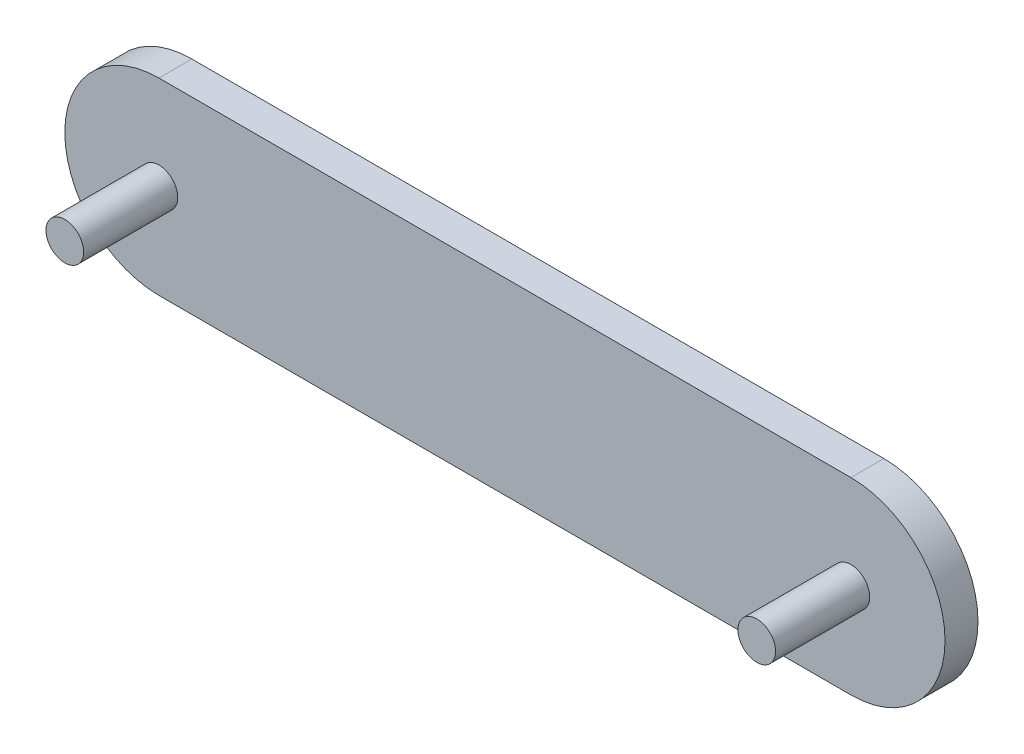
ISO-10303-21;
HEADER;
FILE_DESCRIPTION(('STEP AP214'),'2;1');
FILE_NAME('part.step','',(''),(''),'','','');
FILE_SCHEMA(('AUTOMOTIVE_DESIGN { 1 0 10303 214 1 1 1 1 }'));
ENDSEC;
DATA;
#1=APPLICATION_CONTEXT('core data for automotive mechanical design processes');
#2=APPLICATION_PROTOCOL_DEFINITION('international standard','automotive_design',2000,#1);
#3=PRODUCT_CONTEXT('',#1,'mechanical');
#4=PRODUCT('Part','Part','',(#3));
#5=PRODUCT_RELATED_PRODUCT_CATEGORY('part','',(#4));
#6=PRODUCT_DEFINITION_FORMATION('','',#4);
#7=PRODUCT_DEFINITION_CONTEXT('part definition',#1,'design');
#8=PRODUCT_DEFINITION('design','',#6,#7);
#9=PRODUCT_DEFINITION_SHAPE('','',#8);
#10=(LENGTH_UNIT() NAMED_UNIT(*) SI_UNIT(.MILLI.,.METRE.));
#11=(NAMED_UNIT(*) PLANE_ANGLE_UNIT() SI_UNIT($,.RADIAN.));
#12=(NAMED_UNIT(*) SI_UNIT($,.STERADIAN.) SOLID_ANGLE_UNIT());
#13=UNCERTAINTY_MEASURE_WITH_UNIT(LENGTH_MEASURE(1.E-05),#10,'distance_accuracy_value','');
#14=(GEOMETRIC_REPRESENTATION_CONTEXT(3) GLOBAL_UNCERTAINTY_ASSIGNED_CONTEXT((#13)) GLOBAL_UNIT_ASSIGNED_CONTEXT((#10,
#11,#12)) REPRESENTATION_CONTEXT('',''));
#15=CARTESIAN_POINT('',(0.,0.,0.));
#16=DIRECTION('',(0.,0.,1.));
#17=DIRECTION('',(1.,0.,0.));
#18=AXIS2_PLACEMENT_3D('',#15,#16,#17);
#19=CARTESIAN_POINT('',(0.,20.,7.));
#20=DIRECTION('',(0.,0.,-1.));
#21=DIRECTION('',(-1.,0.,0.));
#22=AXIS2_PLACEMENT_3D('',#19,#20,#21);
#23=CYLINDRICAL_SURFACE('',#22,20.);
#24=CARTESIAN_POINT('',(0.,20.,0.));
#25=DIRECTION('',(0.,0.,1.));
#26=DIRECTION('',(1.,0.,0.));
#27=AXIS2_PLACEMENT_3D('',#24,#25,#26);
#28=CIRCLE('',#27,20.);
#29=CARTESIAN_POINT('',(0.,40.,0.));
#30=VERTEX_POINT('',#29);
#31=CARTESIAN_POINT('',(0.,0.,0.));
#32=VERTEX_POINT('',#31);
#33=EDGE_CURVE('E96',#30,#32,#28,.T.);
#34=ORIENTED_EDGE('',*,*,#33,.T.);
#35=DIRECTION('',(0.,0.,-1.));
#36=VECTOR('',#35,1.);
#37=CARTESIAN_POINT('',(0.,0.,7.));
#38=LINE('',#37,#36);
#39=CARTESIAN_POINT('',(0.,0.,7.));
#40=VERTEX_POINT('',#39);
#41=EDGE_CURVE('E11',#40,#32,#38,.T.);
#42=ORIENTED_EDGE('',*,*,#41,.F.);
#43=CARTESIAN_POINT('',(0.,20.,7.));
#44=DIRECTION('',(0.,0.,1.));
#45=DIRECTION('',(1.,0.,0.));
#46=AXIS2_PLACEMENT_3D('',#43,#44,#45);
#47=CIRCLE('',#46,20.);
#48=CARTESIAN_POINT('',(0.,40.,7.));
#49=VERTEX_POINT('',#48);
#50=EDGE_CURVE('E84',#49,#40,#47,.T.);
#51=ORIENTED_EDGE('',*,*,#50,.F.);
#52=DIRECTION('',(0.,0.,-1.));
#53=VECTOR('',#52,1.);
#54=CARTESIAN_POINT('',(0.,40.,7.));
#55=LINE('',#54,#53);
#56=EDGE_CURVE('E92',#49,#30,#55,.T.);
#57=ORIENTED_EDGE('',*,*,#56,.T.);
#58=EDGE_LOOP('',(#34,#42,#51,#57));
#59=FACE_BOUND('',#58,.T.);
#60=ADVANCED_FACE('F33',(#59),#23,.T.);
#61=CARTESIAN_POINT('',(0.,0.,7.));
#62=DIRECTION('',(0.,1.,0.));
#63=DIRECTION('',(0.,0.,1.));
#64=AXIS2_PLACEMENT_3D('',#61,#62,#63);
#65=PLANE('',#64);
#66=DIRECTION('',(1.,0.,0.));
#67=VECTOR('',#66,1.);
#68=CARTESIAN_POINT('',(0.,0.,0.));
#69=LINE('',#68,#67);
#70=CARTESIAN_POINT('',(147.,0.,0.));
#71=VERTEX_POINT('',#70);
#72=EDGE_CURVE('E88',#32,#71,#69,.T.);
#73=ORIENTED_EDGE('',*,*,#72,.T.);
#74=DIRECTION('',(0.,0.,-1.));
#75=VECTOR('',#74,1.);
#76=CARTESIAN_POINT('',(147.,0.,7.));
#77=LINE('',#76,#75);
#78=CARTESIAN_POINT('',(147.,0.,7.));
#79=VERTEX_POINT('',#78);
#80=EDGE_CURVE('E41',#79,#71,#77,.T.);
#81=ORIENTED_EDGE('',*,*,#80,.F.);
#82=DIRECTION('',(1.,0.,0.));
#83=VECTOR('',#82,1.);
#84=CARTESIAN_POINT('',(0.,0.,7.));
#85=LINE('',#84,#83);
#86=EDGE_CURVE('E79',#40,#79,#85,.T.);
#87=ORIENTED_EDGE('',*,*,#86,.F.);
#88=ORIENTED_EDGE('',*,*,#41,.T.);
#89=EDGE_LOOP('',(#73,#81,#87,#88));
#90=FACE_BOUND('',#89,.T.);
#91=ADVANCED_FACE('F87',(#90),#65,.F.);
#92=CARTESIAN_POINT('',(147.,20.,7.));
#93=DIRECTION('',(0.,0.,-1.));
#94=DIRECTION('',(-1.,0.,0.));
#95=AXIS2_PLACEMENT_3D('',#92,#93,#94);
#96=CYLINDRICAL_SURFACE('',#95,20.);
#97=CARTESIAN_POINT('',(147.,20.,0.));
#98=DIRECTION('',(0.,0.,1.));
#99=DIRECTION('',(1.,0.,0.));
#100=AXIS2_PLACEMENT_3D('',#97,#98,#99);
#101=CIRCLE('',#100,20.);
#102=CARTESIAN_POINT('',(147.,40.,0.));
#103=VERTEX_POINT('',#102);
#104=EDGE_CURVE('E66',#71,#103,#101,.T.);
#105=ORIENTED_EDGE('',*,*,#104,.T.);
#106=DIRECTION('',(0.,0.,-1.));
#107=VECTOR('',#106,1.);
#108=CARTESIAN_POINT('',(147.,40.,7.));
#109=LINE('',#108,#107);
#110=CARTESIAN_POINT('',(147.,40.,7.));
#111=VERTEX_POINT('',#110);
#112=EDGE_CURVE('E89',#111,#103,#109,.T.);
#113=ORIENTED_EDGE('',*,*,#112,.F.);
#114=CARTESIAN_POINT('',(147.,20.,7.));
#115=DIRECTION('',(0.,0.,1.));
#116=DIRECTION('',(1.,0.,0.));
#117=AXIS2_PLACEMENT_3D('',#114,#115,#116);
#118=CIRCLE('',#117,20.);
#119=EDGE_CURVE('E82',#79,#111,#118,.T.);
#120=ORIENTED_EDGE('',*,*,#119,.F.);
#121=ORIENTED_EDGE('',*,*,#80,.T.);
#122=EDGE_LOOP('',(#105,#113,#120,#121));
#123=FACE_BOUND('',#122,.T.);
#124=ADVANCED_FACE('F90',(#123),#96,.T.);
#125=CARTESIAN_POINT('',(0.,40.,7.));
#126=DIRECTION('',(0.,-1.,0.));
#127=DIRECTION('',(0.,0.,-1.));
#128=AXIS2_PLACEMENT_3D('',#125,#126,#127);
#129=PLANE('',#128);
#130=DIRECTION('',(-1.,0.,0.));
#131=VECTOR('',#130,1.);
#132=CARTESIAN_POINT('',(0.,40.,0.));
#133=LINE('',#132,#131);
#134=EDGE_CURVE('E72',#103,#30,#133,.T.);
#135=ORIENTED_EDGE('',*,*,#134,.T.);
#136=ORIENTED_EDGE('',*,*,#56,.F.);
#137=DIRECTION('',(-1.,0.,0.));
#138=VECTOR('',#137,1.);
#139=CARTESIAN_POINT('',(0.,40.,7.));
#140=LINE('',#139,#138);
#141=EDGE_CURVE('E49',#111,#49,#140,.T.);
#142=ORIENTED_EDGE('',*,*,#141,.F.);
#143=ORIENTED_EDGE('',*,*,#112,.T.);
#144=EDGE_LOOP('',(#135,#136,#142,#143));
#145=FACE_BOUND('',#144,.T.);
#146=ADVANCED_FACE('F104',(#145),#129,.F.);
#147=CARTESIAN_POINT('',(0.,20.,7.));
#148=DIRECTION('',(0.,0.,1.));
#149=DIRECTION('',(1.,0.,0.));
#150=AXIS2_PLACEMENT_3D('',#147,#148,#149);
#151=PLANE('',#150);
#152=CARTESIAN_POINT('',(0.,20.,7.));
#153=DIRECTION('',(0.,0.,1.));
#154=DIRECTION('',(1.,0.,0.));
#155=AXIS2_PLACEMENT_3D('',#152,#153,#154);
#156=CIRCLE('',#155,4.);
#157=CARTESIAN_POINT('',(4.,20.,7.));
#158=VERTEX_POINT('',#157);
#159=EDGE_CURVE('E116',#158,#158,#156,.T.);
#160=ORIENTED_EDGE('',*,*,#159,.F.);
#161=EDGE_LOOP('',(#160));
#162=FACE_BOUND('',#161,.T.);
#163=CARTESIAN_POINT('',(147.,20.,7.));
#164=DIRECTION('',(0.,0.,1.));
#165=DIRECTION('',(1.,0.,0.));
#166=AXIS2_PLACEMENT_3D('',#163,#164,#165);
#167=CIRCLE('',#166,3.99999999999999);
#168=CARTESIAN_POINT('',(151.,20.,7.));
#169=VERTEX_POINT('',#168);
#170=EDGE_CURVE('E110',#169,#169,#167,.T.);
#171=ORIENTED_EDGE('',*,*,#170,.F.);
#172=EDGE_LOOP('',(#171));
#173=FACE_BOUND('',#172,.T.);
#174=ORIENTED_EDGE('',*,*,#50,.T.);
#175=ORIENTED_EDGE('',*,*,#86,.T.);
#176=ORIENTED_EDGE('',*,*,#119,.T.);
#177=ORIENTED_EDGE('',*,*,#141,.T.);
#178=EDGE_LOOP('',(#174,#175,#176,#177));
#179=FACE_BOUND('',#178,.T.);
#180=ADVANCED_FACE('F80',(#162,#173,#179),#151,.T.);
#181=CARTESIAN_POINT('',(0.,20.,0.));
#182=DIRECTION('',(0.,0.,1.));
#183=DIRECTION('',(1.,0.,0.));
#184=AXIS2_PLACEMENT_3D('',#181,#182,#183);
#185=PLANE('',#184);
#186=ORIENTED_EDGE('',*,*,#33,.F.);
#187=ORIENTED_EDGE('',*,*,#134,.F.);
#188=ORIENTED_EDGE('',*,*,#104,.F.);
#189=ORIENTED_EDGE('',*,*,#72,.F.);
#190=EDGE_LOOP('',(#186,#187,#188,#189));
#191=FACE_BOUND('',#190,.T.);
#192=ADVANCED_FACE('F107',(#191),#185,.F.);
#193=CARTESIAN_POINT('',(147.,20.,27.));
#194=DIRECTION('',(0.,0.,-1.));
#195=DIRECTION('',(-1.,0.,0.));
#196=AXIS2_PLACEMENT_3D('',#193,#194,#195);
#197=CYLINDRICAL_SURFACE('',#196,3.99999999999999);
#198=CARTESIAN_POINT('',(147.,20.,27.));
#199=DIRECTION('',(0.,0.,1.));
#200=DIRECTION('',(1.,0.,0.));
#201=AXIS2_PLACEMENT_3D('',#198,#199,#200);
#202=CIRCLE('',#201,3.99999999999999);
#203=CARTESIAN_POINT('',(151.,20.,27.));
#204=VERTEX_POINT('',#203);
#205=EDGE_CURVE('E99',#204,#204,#202,.T.);
#206=ORIENTED_EDGE('',*,*,#205,.F.);
#207=EDGE_LOOP('',(#206));
#208=FACE_BOUND('',#207,.T.);
#209=ORIENTED_EDGE('',*,*,#170,.T.);
#210=EDGE_LOOP('',(#209));
#211=FACE_BOUND('',#210,.T.);
#212=ADVANCED_FACE('F136',(#208,#211),#197,.T.);
#213=CARTESIAN_POINT('',(147.,20.,27.));
#214=DIRECTION('',(0.,0.,1.));
#215=DIRECTION('',(1.,0.,0.));
#216=AXIS2_PLACEMENT_3D('',#213,#214,#215);
#217=PLANE('',#216);
#218=ORIENTED_EDGE('',*,*,#205,.T.);
#219=EDGE_LOOP('',(#218));
#220=FACE_BOUND('',#219,.T.);
#221=ADVANCED_FACE('F127',(#220),#217,.T.);
#222=CARTESIAN_POINT('',(0.,20.,27.));
#223=DIRECTION('',(0.,0.,-1.));
#224=DIRECTION('',(-1.,0.,0.));
#225=AXIS2_PLACEMENT_3D('',#222,#223,#224);
#226=CYLINDRICAL_SURFACE('',#225,4.);
#227=CARTESIAN_POINT('',(0.,20.,27.));
#228=DIRECTION('',(0.,0.,1.));
#229=DIRECTION('',(1.,0.,0.));
#230=AXIS2_PLACEMENT_3D('',#227,#228,#229);
#231=CIRCLE('',#230,4.);
#232=CARTESIAN_POINT('',(4.,20.,27.));
#233=VERTEX_POINT('',#232);
#234=EDGE_CURVE('E113',#233,#233,#231,.T.);
#235=ORIENTED_EDGE('',*,*,#234,.F.);
#236=EDGE_LOOP('',(#235));
#237=FACE_BOUND('',#236,.T.);
#238=ORIENTED_EDGE('',*,*,#159,.T.);
#239=EDGE_LOOP('',(#238));
#240=FACE_BOUND('',#239,.T.);
#241=ADVANCED_FACE('F124',(#237,#240),#226,.T.);
#242=CARTESIAN_POINT('',(0.,20.,27.));
#243=DIRECTION('',(0.,0.,1.));
#244=DIRECTION('',(1.,0.,0.));
#245=AXIS2_PLACEMENT_3D('',#242,#243,#244);
#246=PLANE('',#245);
#247=ORIENTED_EDGE('',*,*,#234,.T.);
#248=EDGE_LOOP('',(#247));
#249=FACE_BOUND('',#248,.T.);
#250=ADVANCED_FACE('F122',(#249),#246,.T.);
#251=CLOSED_SHELL('',(#60,#91,#124,#146,#180,#192,#212,#221,#241,#250));
#252=MANIFOLD_SOLID_BREP('B2',#251);
#253=ADVANCED_BREP_SHAPE_REPRESENTATION('',(#18,#252),#14);
#254=SHAPE_DEFINITION_REPRESENTATION(#9,#253);
ENDSEC;
END-ISO-10303-21;
